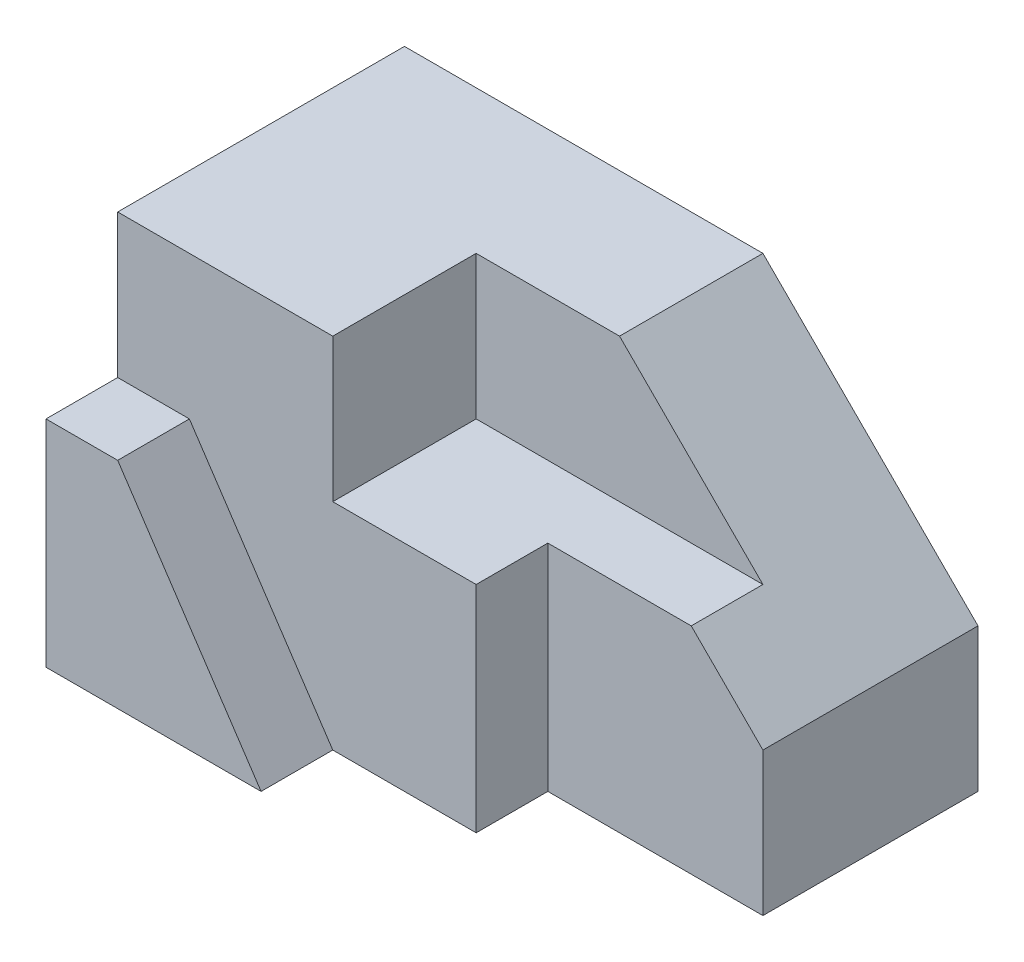
ISO-10303-21;
HEADER;
FILE_DESCRIPTION(('STEP AP214'),'2;1');
FILE_NAME('part.step','',(''),(''),'','','');
FILE_SCHEMA(('AUTOMOTIVE_DESIGN { 1 0 10303 214 1 1 1 1 }'));
ENDSEC;
DATA;
#1=APPLICATION_CONTEXT('core data for automotive mechanical design processes');
#2=APPLICATION_PROTOCOL_DEFINITION('international standard','automotive_design',2000,#1);
#3=PRODUCT_CONTEXT('',#1,'mechanical');
#4=PRODUCT('Part','Part','',(#3));
#5=PRODUCT_RELATED_PRODUCT_CATEGORY('part','',(#4));
#6=PRODUCT_DEFINITION_FORMATION('','',#4);
#7=PRODUCT_DEFINITION_CONTEXT('part definition',#1,'design');
#8=PRODUCT_DEFINITION('design','',#6,#7);
#9=PRODUCT_DEFINITION_SHAPE('','',#8);
#10=(LENGTH_UNIT() NAMED_UNIT(*) SI_UNIT(.MILLI.,.METRE.));
#11=(NAMED_UNIT(*) PLANE_ANGLE_UNIT() SI_UNIT($,.RADIAN.));
#12=(NAMED_UNIT(*) SI_UNIT($,.STERADIAN.) SOLID_ANGLE_UNIT());
#13=UNCERTAINTY_MEASURE_WITH_UNIT(LENGTH_MEASURE(1.E-05),#10,'distance_accuracy_value','');
#14=(GEOMETRIC_REPRESENTATION_CONTEXT(3) GLOBAL_UNCERTAINTY_ASSIGNED_CONTEXT((#13)) GLOBAL_UNIT_ASSIGNED_CONTEXT((#10,
#11,#12)) REPRESENTATION_CONTEXT('',''));
#15=CARTESIAN_POINT('',(0.,0.,0.));
#16=DIRECTION('',(0.,0.,1.));
#17=DIRECTION('',(1.,0.,0.));
#18=AXIS2_PLACEMENT_3D('',#15,#16,#17);
#19=CARTESIAN_POINT('',(80.,56.,-20.));
#20=DIRECTION('',(0.,0.,-1.));
#21=DIRECTION('',(-1.,0.,0.));
#22=AXIS2_PLACEMENT_3D('',#19,#20,#21);
#23=PLANE('',#22);
#24=DIRECTION('',(1.,0.,0.));
#25=VECTOR('',#24,1.);
#26=CARTESIAN_POINT('',(80.,30.,-20.));
#27=LINE('',#26,#25);
#28=CARTESIAN_POINT('',(50.,30.,-20.));
#29=VERTEX_POINT('',#28);
#30=CARTESIAN_POINT('',(70.,30.,-20.));
#31=VERTEX_POINT('',#30);
#32=EDGE_CURVE('E154',#29,#31,#27,.T.);
#33=ORIENTED_EDGE('',*,*,#32,.F.);
#34=DIRECTION('',(0.,-1.,0.));
#35=VECTOR('',#34,1.);
#36=CARTESIAN_POINT('',(50.,56.,-20.));
#37=LINE('',#36,#35);
#38=CARTESIAN_POINT('',(50.,0.,-20.));
#39=VERTEX_POINT('',#38);
#40=EDGE_CURVE('E168',#29,#39,#37,.T.);
#41=ORIENTED_EDGE('',*,*,#40,.T.);
#42=DIRECTION('',(1.,0.,0.));
#43=VECTOR('',#42,1.);
#44=CARTESIAN_POINT('',(80.,0.,-20.));
#45=LINE('',#44,#43);
#46=CARTESIAN_POINT('',(80.,0.,-20.));
#47=VERTEX_POINT('',#46);
#48=EDGE_CURVE('E162',#39,#47,#45,.T.);
#49=ORIENTED_EDGE('',*,*,#48,.T.);
#50=DIRECTION('',(0.,-1.,0.));
#51=VECTOR('',#50,1.);
#52=CARTESIAN_POINT('',(80.,56.,-20.));
#53=LINE('',#52,#51);
#54=CARTESIAN_POINT('',(80.,20.,-20.));
#55=VERTEX_POINT('',#54);
#56=EDGE_CURVE('E164',#55,#47,#53,.T.);
#57=ORIENTED_EDGE('',*,*,#56,.F.);
#58=DIRECTION('',(0.707106781186548,-0.707106781186548,0.));
#59=VECTOR('',#58,1.);
#60=CARTESIAN_POINT('',(50.,50.,-20.));
#61=LINE('',#60,#59);
#62=EDGE_CURVE('E221',#31,#55,#61,.T.);
#63=ORIENTED_EDGE('',*,*,#62,.F.);
#64=EDGE_LOOP('',(#33,#41,#49,#57,#63));
#65=FACE_BOUND('',#64,.T.);
#66=ADVANCED_FACE('F33',(#65),#23,.F.);
#67=CARTESIAN_POINT('',(50.,56.,-10.));
#68=DIRECTION('',(-1.,0.,0.));
#69=DIRECTION('',(0.,0.,1.));
#70=AXIS2_PLACEMENT_3D('',#67,#68,#69);
#71=PLANE('',#70);
#72=DIRECTION('',(0.,0.,-1.));
#73=VECTOR('',#72,1.);
#74=CARTESIAN_POINT('',(50.,30.,-10.));
#75=LINE('',#74,#73);
#76=CARTESIAN_POINT('',(50.,30.,-10.));
#77=VERTEX_POINT('',#76);
#78=EDGE_CURVE('E41',#77,#29,#75,.T.);
#79=ORIENTED_EDGE('',*,*,#78,.F.);
#80=DIRECTION('',(0.,-1.,0.));
#81=VECTOR('',#80,1.);
#82=CARTESIAN_POINT('',(50.,56.,-10.));
#83=LINE('',#82,#81);
#84=CARTESIAN_POINT('',(50.,0.,-10.));
#85=VERTEX_POINT('',#84);
#86=EDGE_CURVE('E148',#77,#85,#83,.T.);
#87=ORIENTED_EDGE('',*,*,#86,.T.);
#88=DIRECTION('',(0.,0.,-1.));
#89=VECTOR('',#88,1.);
#90=CARTESIAN_POINT('',(50.,0.,-10.));
#91=LINE('',#90,#89);
#92=EDGE_CURVE('E159',#85,#39,#91,.T.);
#93=ORIENTED_EDGE('',*,*,#92,.T.);
#94=ORIENTED_EDGE('',*,*,#40,.F.);
#95=EDGE_LOOP('',(#79,#87,#93,#94));
#96=FACE_BOUND('',#95,.T.);
#97=ADVANCED_FACE('F234',(#96),#71,.F.);
#98=CARTESIAN_POINT('',(0.,0.,-50.));
#99=DIRECTION('',(-1.,0.,0.));
#100=DIRECTION('',(0.,0.,1.));
#101=AXIS2_PLACEMENT_3D('',#98,#99,#100);
#102=PLANE('',#101);
#103=DIRECTION('',(0.,0.,1.));
#104=VECTOR('',#103,1.);
#105=CARTESIAN_POINT('',(0.,30.,-10.));
#106=LINE('',#105,#104);
#107=CARTESIAN_POINT('',(0.,30.,-10.));
#108=VERTEX_POINT('',#107);
#109=CARTESIAN_POINT('',(0.,30.,0.));
#110=VERTEX_POINT('',#109);
#111=EDGE_CURVE('E195',#108,#110,#106,.T.);
#112=ORIENTED_EDGE('',*,*,#111,.F.);
#113=DIRECTION('',(0.,-1.,0.));
#114=VECTOR('',#113,1.);
#115=CARTESIAN_POINT('',(0.,30.,-10.));
#116=LINE('',#115,#114);
#117=CARTESIAN_POINT('',(0.,50.,-10.));
#118=VERTEX_POINT('',#117);
#119=EDGE_CURVE('E189',#118,#108,#116,.T.);
#120=ORIENTED_EDGE('',*,*,#119,.F.);
#121=DIRECTION('',(0.,0.,1.));
#122=VECTOR('',#121,1.);
#123=CARTESIAN_POINT('',(0.,50.,-50.));
#124=LINE('',#123,#122);
#125=CARTESIAN_POINT('',(0.,50.,-50.));
#126=VERTEX_POINT('',#125);
#127=EDGE_CURVE('E218',#126,#118,#124,.T.);
#128=ORIENTED_EDGE('',*,*,#127,.F.);
#129=DIRECTION('',(0.,-1.,0.));
#130=VECTOR('',#129,1.);
#131=CARTESIAN_POINT('',(0.,0.,-50.));
#132=LINE('',#131,#130);
#133=CARTESIAN_POINT('',(0.,0.,-50.));
#134=VERTEX_POINT('',#133);
#135=EDGE_CURVE('E202',#126,#134,#132,.T.);
#136=ORIENTED_EDGE('',*,*,#135,.T.);
#137=DIRECTION('',(0.,0.,1.));
#138=VECTOR('',#137,1.);
#139=CARTESIAN_POINT('',(0.,0.,-50.));
#140=LINE('',#139,#138);
#141=CARTESIAN_POINT('',(0.,0.,0.));
#142=VERTEX_POINT('',#141);
#143=EDGE_CURVE('E214',#134,#142,#140,.T.);
#144=ORIENTED_EDGE('',*,*,#143,.T.);
#145=DIRECTION('',(0.,-1.,0.));
#146=VECTOR('',#145,1.);
#147=CARTESIAN_POINT('',(0.,0.,0.));
#148=LINE('',#147,#146);
#149=EDGE_CURVE('E197',#110,#142,#148,.T.);
#150=ORIENTED_EDGE('',*,*,#149,.F.);
#151=EDGE_LOOP('',(#112,#120,#128,#136,#144,#150));
#152=FACE_BOUND('',#151,.T.);
#153=ADVANCED_FACE('F35',(#152),#102,.T.);
#154=CARTESIAN_POINT('',(0.,50.,-50.));
#155=DIRECTION('',(0.,1.,0.));
#156=DIRECTION('',(0.,0.,1.));
#157=AXIS2_PLACEMENT_3D('',#154,#155,#156);
#158=PLANE('',#157);
#159=DIRECTION('',(0.,0.,1.));
#160=VECTOR('',#159,1.);
#161=CARTESIAN_POINT('',(30.,50.,-30.));
#162=LINE('',#161,#160);
#163=CARTESIAN_POINT('',(30.,50.,-30.));
#164=VERTEX_POINT('',#163);
#165=CARTESIAN_POINT('',(30.,50.,-10.));
#166=VERTEX_POINT('',#165);
#167=EDGE_CURVE('E134',#164,#166,#162,.T.);
#168=ORIENTED_EDGE('',*,*,#167,.F.);
#169=DIRECTION('',(-1.,0.,0.));
#170=VECTOR('',#169,1.);
#171=CARTESIAN_POINT('',(30.,50.,-30.));
#172=LINE('',#171,#170);
#173=CARTESIAN_POINT('',(50.,50.,-30.));
#174=VERTEX_POINT('',#173);
#175=EDGE_CURVE('E143',#174,#164,#172,.T.);
#176=ORIENTED_EDGE('',*,*,#175,.F.);
#177=DIRECTION('',(0.,0.,1.));
#178=VECTOR('',#177,1.);
#179=CARTESIAN_POINT('',(50.,50.,-66.));
#180=LINE('',#179,#178);
#181=CARTESIAN_POINT('',(50.,50.,-50.));
#182=VERTEX_POINT('',#181);
#183=EDGE_CURVE('E167',#182,#174,#180,.T.);
#184=ORIENTED_EDGE('',*,*,#183,.F.);
#185=DIRECTION('',(-1.,0.,0.));
#186=VECTOR('',#185,1.);
#187=CARTESIAN_POINT('',(0.,50.,-50.));
#188=LINE('',#187,#186);
#189=EDGE_CURVE('E212',#182,#126,#188,.T.);
#190=ORIENTED_EDGE('',*,*,#189,.T.);
#191=ORIENTED_EDGE('',*,*,#127,.T.);
#192=DIRECTION('',(-1.,0.,0.));
#193=VECTOR('',#192,1.);
#194=CARTESIAN_POINT('',(0.,50.,-10.));
#195=LINE('',#194,#193);
#196=EDGE_CURVE('E187',#166,#118,#195,.T.);
#197=ORIENTED_EDGE('',*,*,#196,.F.);
#198=EDGE_LOOP('',(#168,#176,#184,#190,#191,#197));
#199=FACE_BOUND('',#198,.T.);
#200=ADVANCED_FACE('F254',(#199),#158,.T.);
#201=CARTESIAN_POINT('',(80.,0.,-50.));
#202=DIRECTION('',(1.,0.,0.));
#203=DIRECTION('',(0.,0.,-1.));
#204=AXIS2_PLACEMENT_3D('',#201,#202,#203);
#205=PLANE('',#204);
#206=ORIENTED_EDGE('',*,*,#56,.T.);
#207=DIRECTION('',(0.,0.,1.));
#208=VECTOR('',#207,1.);
#209=CARTESIAN_POINT('',(80.,0.,-50.));
#210=LINE('',#209,#208);
#211=CARTESIAN_POINT('',(80.,0.,-50.));
#212=VERTEX_POINT('',#211);
#213=EDGE_CURVE('E222',#212,#47,#210,.T.);
#214=ORIENTED_EDGE('',*,*,#213,.F.);
#215=DIRECTION('',(0.,1.,0.));
#216=VECTOR('',#215,1.);
#217=CARTESIAN_POINT('',(80.,0.,-50.));
#218=LINE('',#217,#216);
#219=CARTESIAN_POINT('',(80.,20.,-50.));
#220=VERTEX_POINT('',#219);
#221=EDGE_CURVE('E209',#212,#220,#218,.T.);
#222=ORIENTED_EDGE('',*,*,#221,.T.);
#223=DIRECTION('',(0.,0.,1.));
#224=VECTOR('',#223,1.);
#225=CARTESIAN_POINT('',(80.,20.,-66.));
#226=LINE('',#225,#224);
#227=EDGE_CURVE('E171',#220,#55,#226,.T.);
#228=ORIENTED_EDGE('',*,*,#227,.T.);
#229=EDGE_LOOP('',(#206,#214,#222,#228));
#230=FACE_BOUND('',#229,.T.);
#231=ADVANCED_FACE('F241',(#230),#205,.T.);
#232=CARTESIAN_POINT('',(0.,0.,-50.));
#233=DIRECTION('',(0.,-1.,0.));
#234=DIRECTION('',(0.,0.,-1.));
#235=AXIS2_PLACEMENT_3D('',#232,#233,#234);
#236=PLANE('',#235);
#237=ORIENTED_EDGE('',*,*,#48,.F.);
#238=ORIENTED_EDGE('',*,*,#92,.F.);
#239=DIRECTION('',(1.,0.,0.));
#240=VECTOR('',#239,1.);
#241=CARTESIAN_POINT('',(80.,0.,-10.));
#242=LINE('',#241,#240);
#243=CARTESIAN_POINT('',(30.,0.,-10.));
#244=VERTEX_POINT('',#243);
#245=EDGE_CURVE('E185',#244,#85,#242,.T.);
#246=ORIENTED_EDGE('',*,*,#245,.F.);
#247=DIRECTION('',(0.,0.,1.));
#248=VECTOR('',#247,1.);
#249=CARTESIAN_POINT('',(30.,0.,-10.));
#250=LINE('',#249,#248);
#251=CARTESIAN_POINT('',(30.,0.,0.));
#252=VERTEX_POINT('',#251);
#253=EDGE_CURVE('E198',#244,#252,#250,.T.);
#254=ORIENTED_EDGE('',*,*,#253,.T.);
#255=DIRECTION('',(1.,0.,0.));
#256=VECTOR('',#255,1.);
#257=CARTESIAN_POINT('',(0.,0.,0.));
#258=LINE('',#257,#256);
#259=EDGE_CURVE('E206',#142,#252,#258,.T.);
#260=ORIENTED_EDGE('',*,*,#259,.F.);
#261=ORIENTED_EDGE('',*,*,#143,.F.);
#262=DIRECTION('',(1.,0.,0.));
#263=VECTOR('',#262,1.);
#264=CARTESIAN_POINT('',(0.,0.,-50.));
#265=LINE('',#264,#263);
#266=EDGE_CURVE('E205',#134,#212,#265,.T.);
#267=ORIENTED_EDGE('',*,*,#266,.T.);
#268=ORIENTED_EDGE('',*,*,#213,.T.);
#269=EDGE_LOOP('',(#237,#238,#246,#254,#260,#261,#267,#268));
#270=FACE_BOUND('',#269,.T.);
#271=ADVANCED_FACE('F239',(#270),#236,.T.);
#272=CARTESIAN_POINT('',(0.,0.,-50.));
#273=DIRECTION('',(0.,0.,-1.));
#274=DIRECTION('',(-1.,0.,0.));
#275=AXIS2_PLACEMENT_3D('',#272,#273,#274);
#276=PLANE('',#275);
#277=DIRECTION('',(-0.707106781186548,0.707106781186548,0.));
#278=VECTOR('',#277,1.);
#279=CARTESIAN_POINT('',(50.,50.,-50.));
#280=LINE('',#279,#278);
#281=EDGE_CURVE('E174',#220,#182,#280,.T.);
#282=ORIENTED_EDGE('',*,*,#281,.F.);
#283=ORIENTED_EDGE('',*,*,#221,.F.);
#284=ORIENTED_EDGE('',*,*,#266,.F.);
#285=ORIENTED_EDGE('',*,*,#135,.F.);
#286=ORIENTED_EDGE('',*,*,#189,.F.);
#287=EDGE_LOOP('',(#282,#283,#284,#285,#286));
#288=FACE_BOUND('',#287,.T.);
#289=ADVANCED_FACE('F249',(#288),#276,.T.);
#290=CARTESIAN_POINT('',(0.,0.,0.));
#291=DIRECTION('',(0.,0.,-1.));
#292=DIRECTION('',(-1.,0.,0.));
#293=AXIS2_PLACEMENT_3D('',#290,#291,#292);
#294=PLANE('',#293);
#295=DIRECTION('',(0.554700196225229,-0.832050294337844,0.));
#296=VECTOR('',#295,1.);
#297=CARTESIAN_POINT('',(30.,0.,0.));
#298=LINE('',#297,#296);
#299=CARTESIAN_POINT('',(10.,30.,0.));
#300=VERTEX_POINT('',#299);
#301=EDGE_CURVE('E182',#300,#252,#298,.T.);
#302=ORIENTED_EDGE('',*,*,#301,.F.);
#303=DIRECTION('',(1.,0.,0.));
#304=VECTOR('',#303,1.);
#305=CARTESIAN_POINT('',(10.,30.,0.));
#306=LINE('',#305,#304);
#307=EDGE_CURVE('E56',#110,#300,#306,.T.);
#308=ORIENTED_EDGE('',*,*,#307,.F.);
#309=ORIENTED_EDGE('',*,*,#149,.T.);
#310=ORIENTED_EDGE('',*,*,#259,.T.);
#311=EDGE_LOOP('',(#302,#308,#309,#310));
#312=FACE_BOUND('',#311,.T.);
#313=ADVANCED_FACE('F287',(#312),#294,.F.);
#314=CARTESIAN_POINT('',(10.,30.,-10.));
#315=DIRECTION('',(0.,-1.,0.));
#316=DIRECTION('',(0.,0.,-1.));
#317=AXIS2_PLACEMENT_3D('',#314,#315,#316);
#318=PLANE('',#317);
#319=ORIENTED_EDGE('',*,*,#307,.T.);
#320=DIRECTION('',(0.,0.,1.));
#321=VECTOR('',#320,1.);
#322=CARTESIAN_POINT('',(10.,30.,-10.));
#323=LINE('',#322,#321);
#324=CARTESIAN_POINT('',(10.,30.,-10.));
#325=VERTEX_POINT('',#324);
#326=EDGE_CURVE('E192',#325,#300,#323,.T.);
#327=ORIENTED_EDGE('',*,*,#326,.F.);
#328=DIRECTION('',(1.,0.,0.));
#329=VECTOR('',#328,1.);
#330=CARTESIAN_POINT('',(10.,30.,-10.));
#331=LINE('',#330,#329);
#332=EDGE_CURVE('E178',#108,#325,#331,.T.);
#333=ORIENTED_EDGE('',*,*,#332,.F.);
#334=ORIENTED_EDGE('',*,*,#111,.T.);
#335=EDGE_LOOP('',(#319,#327,#333,#334));
#336=FACE_BOUND('',#335,.T.);
#337=ADVANCED_FACE('F283',(#336),#318,.F.);
#338=CARTESIAN_POINT('',(30.,0.,-10.));
#339=DIRECTION('',(-0.832050294337844,-0.554700196225229,0.));
#340=DIRECTION('',(0.554700196225229,-0.832050294337844,0.));
#341=AXIS2_PLACEMENT_3D('',#338,#339,#340);
#342=PLANE('',#341);
#343=ORIENTED_EDGE('',*,*,#301,.T.);
#344=ORIENTED_EDGE('',*,*,#253,.F.);
#345=DIRECTION('',(0.554700196225229,-0.832050294337844,0.));
#346=VECTOR('',#345,1.);
#347=CARTESIAN_POINT('',(30.,0.,-10.));
#348=LINE('',#347,#346);
#349=EDGE_CURVE('E181',#325,#244,#348,.T.);
#350=ORIENTED_EDGE('',*,*,#349,.F.);
#351=ORIENTED_EDGE('',*,*,#326,.T.);
#352=EDGE_LOOP('',(#343,#344,#350,#351));
#353=FACE_BOUND('',#352,.T.);
#354=ADVANCED_FACE('F280',(#353),#342,.F.);
#355=CARTESIAN_POINT('',(0.,0.,-10.));
#356=DIRECTION('',(0.,0.,-1.));
#357=DIRECTION('',(-1.,0.,0.));
#358=AXIS2_PLACEMENT_3D('',#355,#356,#357);
#359=PLANE('',#358);
#360=DIRECTION('',(1.,0.,0.));
#361=VECTOR('',#360,1.);
#362=CARTESIAN_POINT('',(30.,30.,-10.));
#363=LINE('',#362,#361);
#364=CARTESIAN_POINT('',(30.,30.,-10.));
#365=VERTEX_POINT('',#364);
#366=EDGE_CURVE('E48',#365,#77,#363,.T.);
#367=ORIENTED_EDGE('',*,*,#366,.F.);
#368=DIRECTION('',(0.,1.,0.));
#369=VECTOR('',#368,1.);
#370=CARTESIAN_POINT('',(30.,30.,-10.));
#371=LINE('',#370,#369);
#372=EDGE_CURVE('E129',#365,#166,#371,.T.);
#373=ORIENTED_EDGE('',*,*,#372,.T.);
#374=ORIENTED_EDGE('',*,*,#196,.T.);
#375=ORIENTED_EDGE('',*,*,#119,.T.);
#376=ORIENTED_EDGE('',*,*,#332,.T.);
#377=ORIENTED_EDGE('',*,*,#349,.T.);
#378=ORIENTED_EDGE('',*,*,#245,.T.);
#379=ORIENTED_EDGE('',*,*,#86,.F.);
#380=EDGE_LOOP('',(#367,#373,#374,#375,#376,#377,#378,#379));
#381=FACE_BOUND('',#380,.T.);
#382=ADVANCED_FACE('F146',(#381),#359,.F.);
#383=CARTESIAN_POINT('',(50.,50.,-66.));
#384=DIRECTION('',(-0.707106781186547,-0.707106781186547,0.));
#385=DIRECTION('',(0.707106781186548,-0.707106781186548,0.));
#386=AXIS2_PLACEMENT_3D('',#383,#384,#385);
#387=PLANE('',#386);
#388=ORIENTED_EDGE('',*,*,#183,.T.);
#389=DIRECTION('',(0.707106781186548,-0.707106781186548,0.));
#390=VECTOR('',#389,1.);
#391=CARTESIAN_POINT('',(50.,50.,-30.));
#392=LINE('',#391,#390);
#393=CARTESIAN_POINT('',(70.,30.,-30.));
#394=VERTEX_POINT('',#393);
#395=EDGE_CURVE('E11',#174,#394,#392,.T.);
#396=ORIENTED_EDGE('',*,*,#395,.T.);
#397=DIRECTION('',(0.,0.,-1.));
#398=VECTOR('',#397,1.);
#399=CARTESIAN_POINT('',(70.,30.,-66.));
#400=LINE('',#399,#398);
#401=EDGE_CURVE('E157',#31,#394,#400,.T.);
#402=ORIENTED_EDGE('',*,*,#401,.F.);
#403=ORIENTED_EDGE('',*,*,#62,.T.);
#404=ORIENTED_EDGE('',*,*,#227,.F.);
#405=ORIENTED_EDGE('',*,*,#281,.T.);
#406=EDGE_LOOP('',(#388,#396,#402,#403,#404,#405));
#407=FACE_BOUND('',#406,.T.);
#408=ADVANCED_FACE('F245',(#407),#387,.F.);
#409=CARTESIAN_POINT('',(30.,30.,-30.));
#410=DIRECTION('',(0.,0.,-1.));
#411=DIRECTION('',(-1.,0.,0.));
#412=AXIS2_PLACEMENT_3D('',#409,#410,#411);
#413=PLANE('',#412);
#414=ORIENTED_EDGE('',*,*,#175,.T.);
#415=DIRECTION('',(0.,1.,0.));
#416=VECTOR('',#415,1.);
#417=CARTESIAN_POINT('',(30.,30.,-30.));
#418=LINE('',#417,#416);
#419=CARTESIAN_POINT('',(30.,30.,-30.));
#420=VERTEX_POINT('',#419);
#421=EDGE_CURVE('E137',#420,#164,#418,.T.);
#422=ORIENTED_EDGE('',*,*,#421,.F.);
#423=DIRECTION('',(-1.,0.,0.));
#424=VECTOR('',#423,1.);
#425=CARTESIAN_POINT('',(30.,30.,-30.));
#426=LINE('',#425,#424);
#427=EDGE_CURVE('E138',#394,#420,#426,.T.);
#428=ORIENTED_EDGE('',*,*,#427,.F.);
#429=ORIENTED_EDGE('',*,*,#395,.F.);
#430=EDGE_LOOP('',(#414,#422,#428,#429));
#431=FACE_BOUND('',#430,.T.);
#432=ADVANCED_FACE('F261',(#431),#413,.F.);
#433=CARTESIAN_POINT('',(0.,30.,0.));
#434=DIRECTION('',(0.,1.,0.));
#435=DIRECTION('',(0.,0.,1.));
#436=AXIS2_PLACEMENT_3D('',#433,#434,#435);
#437=PLANE('',#436);
#438=ORIENTED_EDGE('',*,*,#401,.T.);
#439=ORIENTED_EDGE('',*,*,#427,.T.);
#440=DIRECTION('',(0.,0.,1.));
#441=VECTOR('',#440,1.);
#442=CARTESIAN_POINT('',(30.,30.,-30.));
#443=LINE('',#442,#441);
#444=EDGE_CURVE('E132',#420,#365,#443,.T.);
#445=ORIENTED_EDGE('',*,*,#444,.T.);
#446=ORIENTED_EDGE('',*,*,#366,.T.);
#447=ORIENTED_EDGE('',*,*,#78,.T.);
#448=ORIENTED_EDGE('',*,*,#32,.T.);
#449=EDGE_LOOP('',(#438,#439,#445,#446,#447,#448));
#450=FACE_BOUND('',#449,.T.);
#451=ADVANCED_FACE('F140',(#450),#437,.T.);
#452=CARTESIAN_POINT('',(30.,30.,-30.));
#453=DIRECTION('',(-1.,0.,0.));
#454=DIRECTION('',(0.,0.,1.));
#455=AXIS2_PLACEMENT_3D('',#452,#453,#454);
#456=PLANE('',#455);
#457=ORIENTED_EDGE('',*,*,#167,.T.);
#458=ORIENTED_EDGE('',*,*,#372,.F.);
#459=ORIENTED_EDGE('',*,*,#444,.F.);
#460=ORIENTED_EDGE('',*,*,#421,.T.);
#461=EDGE_LOOP('',(#457,#458,#459,#460));
#462=FACE_BOUND('',#461,.T.);
#463=ADVANCED_FACE('F130',(#462),#456,.F.);
#464=CLOSED_SHELL('',(#66,#97,#153,#200,#231,#271,#289,#313,#337,#354,#382,#408,#432,#451,#463));
#465=MANIFOLD_SOLID_BREP('B2',#464);
#466=ADVANCED_BREP_SHAPE_REPRESENTATION('',(#18,#465),#14);
#467=SHAPE_DEFINITION_REPRESENTATION(#9,#466);
ENDSEC;
END-ISO-10303-21;
